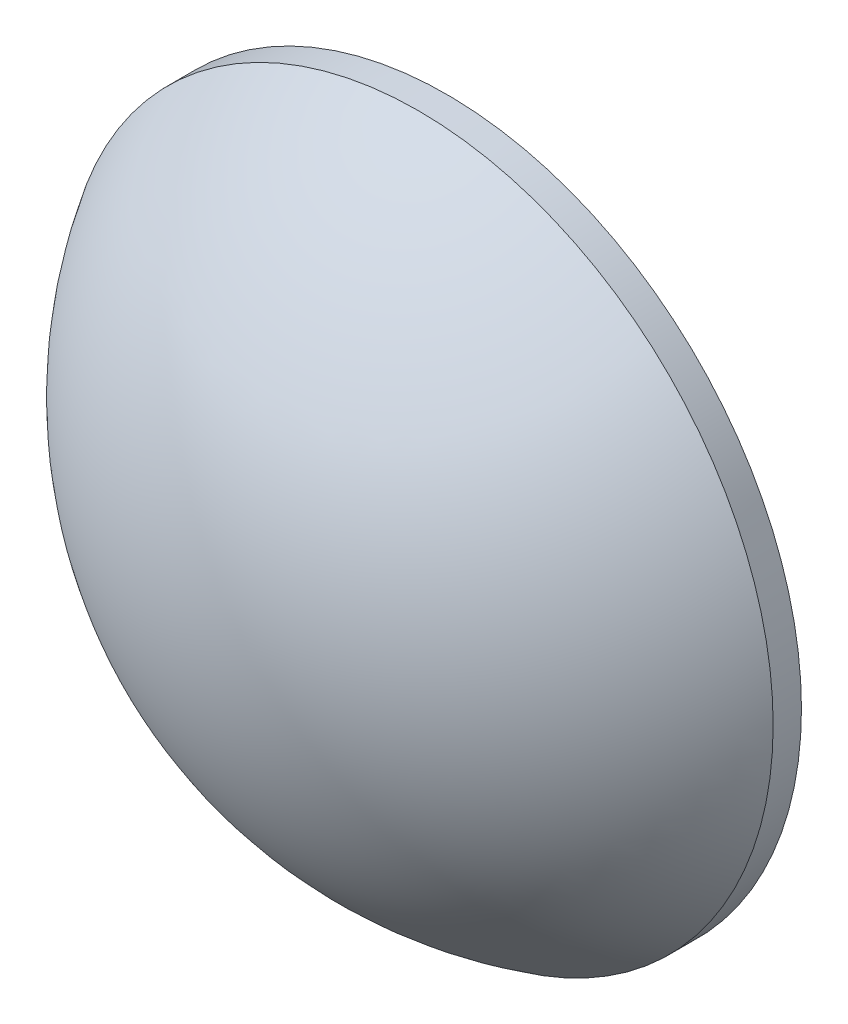
ISO-10303-21;
HEADER;
FILE_DESCRIPTION(('STEP AP214'),'2;1');
FILE_NAME('part.step','',(''),(''),'','','');
FILE_SCHEMA(('AUTOMOTIVE_DESIGN { 1 0 10303 214 1 1 1 1 }'));
ENDSEC;
DATA;
#1=APPLICATION_CONTEXT('core data for automotive mechanical design processes');
#2=APPLICATION_PROTOCOL_DEFINITION('international standard','automotive_design',2000,#1);
#3=PRODUCT_CONTEXT('',#1,'mechanical');
#4=PRODUCT('Part','Part','',(#3));
#5=PRODUCT_RELATED_PRODUCT_CATEGORY('part','',(#4));
#6=PRODUCT_DEFINITION_FORMATION('','',#4);
#7=PRODUCT_DEFINITION_CONTEXT('part definition',#1,'design');
#8=PRODUCT_DEFINITION('design','',#6,#7);
#9=PRODUCT_DEFINITION_SHAPE('','',#8);
#10=(LENGTH_UNIT() NAMED_UNIT(*) SI_UNIT(.MILLI.,.METRE.));
#11=(NAMED_UNIT(*) PLANE_ANGLE_UNIT() SI_UNIT($,.RADIAN.));
#12=(NAMED_UNIT(*) SI_UNIT($,.STERADIAN.) SOLID_ANGLE_UNIT());
#13=UNCERTAINTY_MEASURE_WITH_UNIT(LENGTH_MEASURE(1.E-05),#10,'distance_accuracy_value','');
#14=(GEOMETRIC_REPRESENTATION_CONTEXT(3) GLOBAL_UNCERTAINTY_ASSIGNED_CONTEXT((#13)) GLOBAL_UNIT_ASSIGNED_CONTEXT((#10,
#11,#12)) REPRESENTATION_CONTEXT('',''));
#15=CARTESIAN_POINT('',(0.,0.,0.));
#16=DIRECTION('',(0.,0.,1.));
#17=DIRECTION('',(1.,0.,0.));
#18=AXIS2_PLACEMENT_3D('',#15,#16,#17);
#19=CARTESIAN_POINT('',(0.,0.,-31.69));
#20=DIRECTION('',(0.,0.,1.));
#21=DIRECTION('',(0.,1.,0.));
#22=AXIS2_PLACEMENT_3D('',#19,#20,#21);
#23=SPHERICAL_SURFACE('',#22,43.78);
#24=CARTESIAN_POINT('',(0.,0.,-9.09711616459731));
#25=DIRECTION('',(0.,0.,1.));
#26=DIRECTION('',(1.,0.,0.));
#27=AXIS2_PLACEMENT_3D('',#24,#25,#26);
#28=CIRCLE('',#27,37.5);
#29=CARTESIAN_POINT('',(37.5,0.,-9.09711616459731));
#30=VERTEX_POINT('',#29);
#31=EDGE_CURVE('E8',#30,#30,#28,.T.);
#32=ORIENTED_EDGE('',*,*,#31,.T.);
#33=EDGE_LOOP('',(#32));
#34=FACE_BOUND('',#33,.T.);
#35=ADVANCED_FACE('F12',(#34),#23,.T.);
#36=CARTESIAN_POINT('',(0.,0.,4.30813204540037));
#37=DIRECTION('',(0.,0.,1.));
#38=DIRECTION('',(1.,0.,0.));
#39=AXIS2_PLACEMENT_3D('',#36,#37,#38);
#40=CYLINDRICAL_SURFACE('',#39,37.5);
#41=ORIENTED_EDGE('',*,*,#31,.F.);
#42=EDGE_LOOP('',(#41));
#43=FACE_BOUND('',#42,.T.);
#44=CARTESIAN_POINT('',(0.,0.,-12.09));
#45=DIRECTION('',(0.,0.,1.));
#46=DIRECTION('',(1.,0.,0.));
#47=AXIS2_PLACEMENT_3D('',#44,#45,#46);
#48=CIRCLE('',#47,37.5);
#49=CARTESIAN_POINT('',(37.5,0.,-12.09));
#50=VERTEX_POINT('',#49);
#51=EDGE_CURVE('E18',#50,#50,#48,.T.);
#52=ORIENTED_EDGE('',*,*,#51,.T.);
#53=EDGE_LOOP('',(#52));
#54=FACE_BOUND('',#53,.T.);
#55=ADVANCED_FACE('F24',(#43,#54),#40,.T.);
#56=CARTESIAN_POINT('',(0.,0.,-12.09));
#57=DIRECTION('',(0.,0.,1.));
#58=DIRECTION('',(1.,0.,0.));
#59=AXIS2_PLACEMENT_3D('',#56,#57,#58);
#60=PLANE('',#59);
#61=ORIENTED_EDGE('',*,*,#51,.F.);
#62=EDGE_LOOP('',(#61));
#63=FACE_BOUND('',#62,.T.);
#64=ADVANCED_FACE('F26',(#63),#60,.F.);
#65=CLOSED_SHELL('',(#35,#55,#64));
#66=MANIFOLD_SOLID_BREP('B1',#65);
#67=ADVANCED_BREP_SHAPE_REPRESENTATION('',(#18,#66),#14);
#68=SHAPE_DEFINITION_REPRESENTATION(#9,#67);
ENDSEC;
END-ISO-10303-21;
